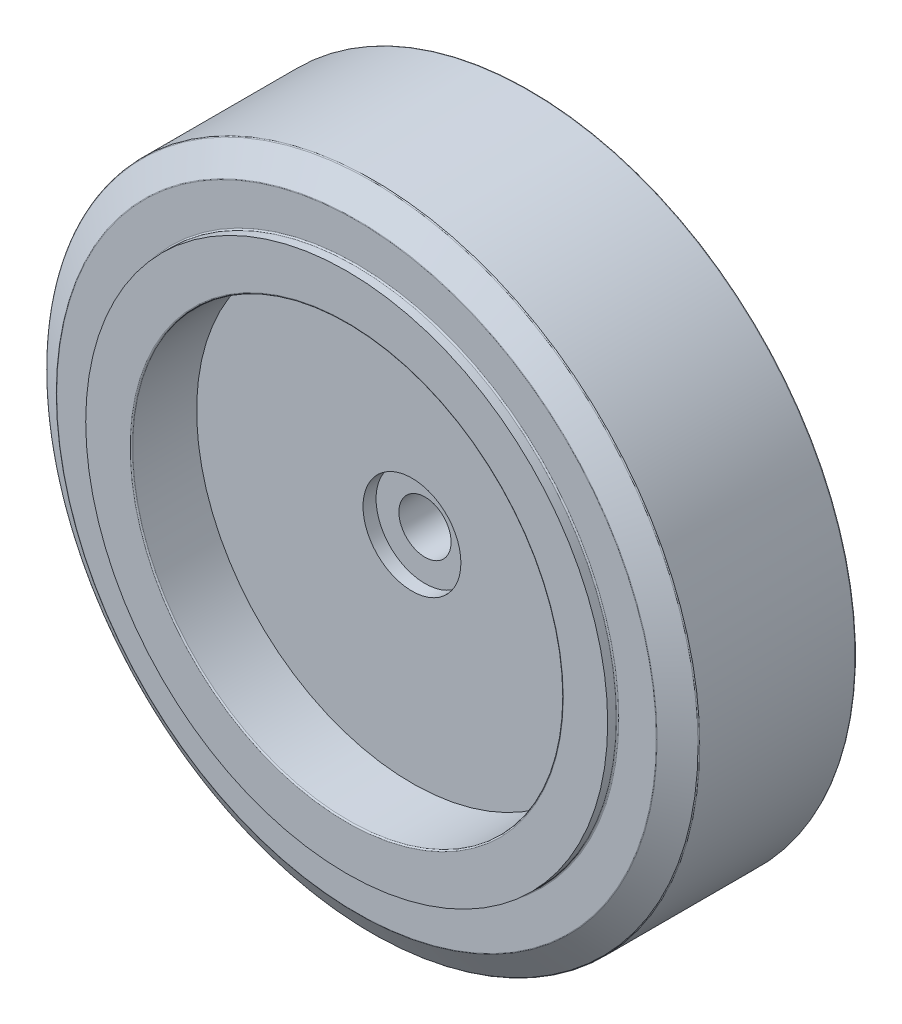
ISO-10303-21;
HEADER;
FILE_DESCRIPTION(('STEP AP214'),'2;1');
FILE_NAME('part.step','',(''),(''),'','','');
FILE_SCHEMA(('AUTOMOTIVE_DESIGN { 1 0 10303 214 1 1 1 1 }'));
ENDSEC;
DATA;
#1=APPLICATION_CONTEXT('core data for automotive mechanical design processes');
#2=APPLICATION_PROTOCOL_DEFINITION('international standard','automotive_design',2000,#1);
#3=PRODUCT_CONTEXT('',#1,'mechanical');
#4=PRODUCT('Part','Part','',(#3));
#5=PRODUCT_RELATED_PRODUCT_CATEGORY('part','',(#4));
#6=PRODUCT_DEFINITION_FORMATION('','',#4);
#7=PRODUCT_DEFINITION_CONTEXT('part definition',#1,'design');
#8=PRODUCT_DEFINITION('design','',#6,#7);
#9=PRODUCT_DEFINITION_SHAPE('','',#8);
#10=(LENGTH_UNIT() NAMED_UNIT(*) SI_UNIT(.MILLI.,.METRE.));
#11=(NAMED_UNIT(*) PLANE_ANGLE_UNIT() SI_UNIT($,.RADIAN.));
#12=(NAMED_UNIT(*) SI_UNIT($,.STERADIAN.) SOLID_ANGLE_UNIT());
#13=UNCERTAINTY_MEASURE_WITH_UNIT(LENGTH_MEASURE(1.E-05),#10,'distance_accuracy_value','');
#14=(GEOMETRIC_REPRESENTATION_CONTEXT(3) GLOBAL_UNCERTAINTY_ASSIGNED_CONTEXT((#13)) GLOBAL_UNIT_ASSIGNED_CONTEXT((#10,
#11,#12)) REPRESENTATION_CONTEXT('',''));
#15=CARTESIAN_POINT('',(0.,0.,0.));
#16=DIRECTION('',(0.,0.,1.));
#17=DIRECTION('',(1.,0.,0.));
#18=AXIS2_PLACEMENT_3D('',#15,#16,#17);
#19=CARTESIAN_POINT('',(0.,0.,-11.8891504716986));
#20=DIRECTION('',(0.,0.,-1.));
#21=DIRECTION('',(-1.,0.,0.));
#22=AXIS2_PLACEMENT_3D('',#19,#20,#21);
#23=TOROIDAL_SURFACE('',#22,49.8,0.2);
#24=CARTESIAN_POINT('',(0.,0.,-11.8891504716986));
#25=DIRECTION('',(0.,0.,1.));
#26=DIRECTION('',(-1.,0.,0.));
#27=AXIS2_PLACEMENT_3D('',#24,#25,#26);
#28=CIRCLE('',#27,50.);
#29=CARTESIAN_POINT('',(-50.,0.,-11.8891504716986));
#30=VERTEX_POINT('',#29);
#31=EDGE_CURVE('E40',#30,#30,#28,.T.);
#32=ORIENTED_EDGE('',*,*,#31,.F.);
#33=EDGE_LOOP('',(#32));
#34=FACE_BOUND('',#33,.T.);
#35=CARTESIAN_POINT('',(0.,0.,-12.0587501324996));
#36=DIRECTION('',(0.,0.,-1.));
#37=DIRECTION('',(1.,0.,0.));
#38=AXIS2_PLACEMENT_3D('',#35,#36,#37);
#39=CIRCLE('',#38,49.9059997880006);
#40=CARTESIAN_POINT('',(-49.9059997880006,0.,-12.0587501324996));
#41=VERTEX_POINT('',#40);
#42=EDGE_CURVE('E27',#41,#41,#39,.T.);
#43=ORIENTED_EDGE('',*,*,#42,.F.);
#44=EDGE_LOOP('',(#43));
#45=FACE_BOUND('',#44,.T.);
#46=ADVANCED_FACE('F16',(#34,#45),#23,.T.);
#47=CARTESIAN_POINT('',(0.,0.,14.3));
#48=DIRECTION('',(0.,0.,1.));
#49=DIRECTION('',(1.,0.,0.));
#50=AXIS2_PLACEMENT_3D('',#47,#48,#49);
#51=TOROIDAL_SURFACE('',#50,45.9426407547177,0.2);
#52=CARTESIAN_POINT('',(0.,0.,14.469599660801));
#53=DIRECTION('',(0.,0.,-1.));
#54=DIRECTION('',(1.,0.,0.));
#55=AXIS2_PLACEMENT_3D('',#52,#53,#54);
#56=CIRCLE('',#55,46.0486405427184);
#57=CARTESIAN_POINT('',(46.0486405427184,0.,14.469599660801));
#58=VERTEX_POINT('',#57);
#59=EDGE_CURVE('E174',#58,#58,#56,.T.);
#60=ORIENTED_EDGE('',*,*,#59,.F.);
#61=EDGE_LOOP('',(#60));
#62=FACE_BOUND('',#61,.T.);
#63=CARTESIAN_POINT('',(0.,0.,14.5));
#64=DIRECTION('',(0.,0.,1.));
#65=DIRECTION('',(1.,0.,0.));
#66=AXIS2_PLACEMENT_3D('',#63,#64,#65);
#67=CIRCLE('',#66,45.9426407547177);
#68=CARTESIAN_POINT('',(45.9426407547177,0.,14.5));
#69=VERTEX_POINT('',#68);
#70=EDGE_CURVE('E143',#69,#69,#67,.T.);
#71=ORIENTED_EDGE('',*,*,#70,.F.);
#72=EDGE_LOOP('',(#71));
#73=FACE_BOUND('',#72,.T.);
#74=ADVANCED_FACE('F274',(#62,#73),#51,.T.);
#75=CARTESIAN_POINT('',(0.,0.,14.7));
#76=DIRECTION('',(0.,0.,1.));
#77=DIRECTION('',(1.,0.,0.));
#78=AXIS2_PLACEMENT_3D('',#75,#76,#77);
#79=TOROIDAL_SURFACE('',#78,40.2,0.2);
#80=CARTESIAN_POINT('',(0.,0.,14.7));
#81=DIRECTION('',(0.,0.,1.));
#82=DIRECTION('',(1.,0.,0.));
#83=AXIS2_PLACEMENT_3D('',#80,#81,#82);
#84=CIRCLE('',#83,40.);
#85=CARTESIAN_POINT('',(40.,0.,14.7));
#86=VERTEX_POINT('',#85);
#87=EDGE_CURVE('E205',#86,#86,#84,.T.);
#88=ORIENTED_EDGE('',*,*,#87,.F.);
#89=EDGE_LOOP('',(#88));
#90=FACE_BOUND('',#89,.T.);
#91=CARTESIAN_POINT('',(0.,0.,14.5));
#92=DIRECTION('',(0.,0.,-1.));
#93=DIRECTION('',(1.,0.,0.));
#94=AXIS2_PLACEMENT_3D('',#91,#92,#93);
#95=CIRCLE('',#94,40.2);
#96=CARTESIAN_POINT('',(40.2,0.,14.5));
#97=VERTEX_POINT('',#96);
#98=EDGE_CURVE('E224',#97,#97,#95,.T.);
#99=ORIENTED_EDGE('',*,*,#98,.F.);
#100=EDGE_LOOP('',(#99));
#101=FACE_BOUND('',#100,.T.);
#102=ADVANCED_FACE('F279',(#90,#101),#79,.F.);
#103=CARTESIAN_POINT('',(0.,0.,-14.3));
#104=DIRECTION('',(0.,0.,-1.));
#105=DIRECTION('',(-1.,0.,0.));
#106=AXIS2_PLACEMENT_3D('',#103,#104,#105);
#107=TOROIDAL_SURFACE('',#106,45.9426407547177,0.2);
#108=CARTESIAN_POINT('',(0.,0.,-14.469599660801));
#109=DIRECTION('',(0.,0.,1.));
#110=DIRECTION('',(-1.,0.,0.));
#111=AXIS2_PLACEMENT_3D('',#108,#109,#110);
#112=CIRCLE('',#111,46.0486405427184);
#113=CARTESIAN_POINT('',(-46.0486405427184,0.,-14.469599660801));
#114=VERTEX_POINT('',#113);
#115=EDGE_CURVE('E11',#114,#114,#112,.T.);
#116=ORIENTED_EDGE('',*,*,#115,.F.);
#117=EDGE_LOOP('',(#116));
#118=FACE_BOUND('',#117,.T.);
#119=CARTESIAN_POINT('',(0.,0.,-14.5));
#120=DIRECTION('',(0.,0.,-1.));
#121=DIRECTION('',(-1.,0.,0.));
#122=AXIS2_PLACEMENT_3D('',#119,#120,#121);
#123=CIRCLE('',#122,45.9426407547177);
#124=CARTESIAN_POINT('',(-45.9426407547177,0.,-14.5));
#125=VERTEX_POINT('',#124);
#126=EDGE_CURVE('E230',#125,#125,#123,.T.);
#127=ORIENTED_EDGE('',*,*,#126,.F.);
#128=EDGE_LOOP('',(#127));
#129=FACE_BOUND('',#128,.T.);
#130=ADVANCED_FACE('F293',(#118,#129),#107,.T.);
#131=CARTESIAN_POINT('',(0.,0.,11.8891504716986));
#132=DIRECTION('',(0.,0.,1.));
#133=DIRECTION('',(1.,0.,0.));
#134=AXIS2_PLACEMENT_3D('',#131,#132,#133);
#135=TOROIDAL_SURFACE('',#134,49.8,0.2);
#136=CARTESIAN_POINT('',(0.,0.,11.8891504716986));
#137=DIRECTION('',(0.,0.,-1.));
#138=DIRECTION('',(1.,0.,0.));
#139=AXIS2_PLACEMENT_3D('',#136,#137,#138);
#140=CIRCLE('',#139,50.);
#141=CARTESIAN_POINT('',(50.,0.,11.8891504716986));
#142=VERTEX_POINT('',#141);
#143=EDGE_CURVE('E145',#142,#142,#140,.T.);
#144=ORIENTED_EDGE('',*,*,#143,.F.);
#145=EDGE_LOOP('',(#144));
#146=FACE_BOUND('',#145,.T.);
#147=CARTESIAN_POINT('',(0.,0.,12.0587501324996));
#148=DIRECTION('',(0.,0.,1.));
#149=DIRECTION('',(-1.,0.,0.));
#150=AXIS2_PLACEMENT_3D('',#147,#148,#149);
#151=CIRCLE('',#150,49.9059997880006);
#152=CARTESIAN_POINT('',(49.9059997880006,0.,12.0587501324996));
#153=VERTEX_POINT('',#152);
#154=EDGE_CURVE('E172',#153,#153,#151,.T.);
#155=ORIENTED_EDGE('',*,*,#154,.F.);
#156=EDGE_LOOP('',(#155));
#157=FACE_BOUND('',#156,.T.);
#158=ADVANCED_FACE('F332',(#146,#157),#135,.T.);
#159=CARTESIAN_POINT('',(0.,0.,-14.7));
#160=DIRECTION('',(0.,0.,-1.));
#161=DIRECTION('',(-1.,0.,0.));
#162=AXIS2_PLACEMENT_3D('',#159,#160,#161);
#163=TOROIDAL_SURFACE('',#162,40.2,0.2);
#164=CARTESIAN_POINT('',(0.,0.,-14.7));
#165=DIRECTION('',(0.,0.,-1.));
#166=DIRECTION('',(-1.,0.,0.));
#167=AXIS2_PLACEMENT_3D('',#164,#165,#166);
#168=CIRCLE('',#167,40.);
#169=CARTESIAN_POINT('',(-40.,0.,-14.7));
#170=VERTEX_POINT('',#169);
#171=EDGE_CURVE('E128',#170,#170,#168,.T.);
#172=ORIENTED_EDGE('',*,*,#171,.F.);
#173=EDGE_LOOP('',(#172));
#174=FACE_BOUND('',#173,.T.);
#175=CARTESIAN_POINT('',(0.,0.,-14.5));
#176=DIRECTION('',(0.,0.,1.));
#177=DIRECTION('',(-1.,0.,0.));
#178=AXIS2_PLACEMENT_3D('',#175,#176,#177);
#179=CIRCLE('',#178,40.2);
#180=CARTESIAN_POINT('',(-40.2,0.,-14.5));
#181=VERTEX_POINT('',#180);
#182=EDGE_CURVE('E196',#181,#181,#179,.T.);
#183=ORIENTED_EDGE('',*,*,#182,.F.);
#184=EDGE_LOOP('',(#183));
#185=FACE_BOUND('',#184,.T.);
#186=ADVANCED_FACE('F335',(#174,#185),#163,.F.);
#187=CARTESIAN_POINT('',(0.,0.,-15.8));
#188=DIRECTION('',(0.,0.,1.));
#189=DIRECTION('',(1.,0.,0.));
#190=AXIS2_PLACEMENT_3D('',#187,#188,#189);
#191=TOROIDAL_SURFACE('',#190,33.2,0.2);
#192=CARTESIAN_POINT('',(0.,0.,-15.8));
#193=DIRECTION('',(0.,0.,-1.));
#194=DIRECTION('',(1.,0.,0.));
#195=AXIS2_PLACEMENT_3D('',#192,#193,#194);
#196=CIRCLE('',#195,33.);
#197=CARTESIAN_POINT('',(33.,0.,-15.8));
#198=VERTEX_POINT('',#197);
#199=EDGE_CURVE('E122',#198,#198,#196,.T.);
#200=ORIENTED_EDGE('',*,*,#199,.F.);
#201=EDGE_LOOP('',(#200));
#202=FACE_BOUND('',#201,.T.);
#203=CARTESIAN_POINT('',(0.,0.,-16.));
#204=DIRECTION('',(0.,0.,1.));
#205=DIRECTION('',(1.,0.,0.));
#206=AXIS2_PLACEMENT_3D('',#203,#204,#205);
#207=CIRCLE('',#206,33.2);
#208=CARTESIAN_POINT('',(33.2,0.,-16.));
#209=VERTEX_POINT('',#208);
#210=EDGE_CURVE('E194',#209,#209,#207,.T.);
#211=ORIENTED_EDGE('',*,*,#210,.F.);
#212=EDGE_LOOP('',(#211));
#213=FACE_BOUND('',#212,.T.);
#214=ADVANCED_FACE('F123',(#202,#213),#191,.T.);
#215=CARTESIAN_POINT('',(0.,0.,15.8));
#216=DIRECTION('',(0.,0.,1.));
#217=DIRECTION('',(1.,0.,0.));
#218=AXIS2_PLACEMENT_3D('',#215,#216,#217);
#219=TOROIDAL_SURFACE('',#218,33.2,0.2);
#220=CARTESIAN_POINT('',(0.,0.,16.));
#221=DIRECTION('',(0.,0.,-1.));
#222=DIRECTION('',(1.,0.,0.));
#223=AXIS2_PLACEMENT_3D('',#220,#221,#222);
#224=CIRCLE('',#223,33.2);
#225=CARTESIAN_POINT('',(33.2,0.,16.));
#226=VERTEX_POINT('',#225);
#227=EDGE_CURVE('E168',#226,#226,#224,.T.);
#228=ORIENTED_EDGE('',*,*,#227,.F.);
#229=EDGE_LOOP('',(#228));
#230=FACE_BOUND('',#229,.T.);
#231=CARTESIAN_POINT('',(0.,0.,15.8));
#232=DIRECTION('',(0.,0.,1.));
#233=DIRECTION('',(1.,0.,0.));
#234=AXIS2_PLACEMENT_3D('',#231,#232,#233);
#235=CIRCLE('',#234,33.);
#236=CARTESIAN_POINT('',(33.,0.,15.8));
#237=VERTEX_POINT('',#236);
#238=EDGE_CURVE('E153',#237,#237,#235,.T.);
#239=ORIENTED_EDGE('',*,*,#238,.F.);
#240=EDGE_LOOP('',(#239));
#241=FACE_BOUND('',#240,.T.);
#242=ADVANCED_FACE('F313',(#230,#241),#219,.T.);
#243=CARTESIAN_POINT('',(0.,0.,-14.5));
#244=DIRECTION('',(0.,0.,1.));
#245=DIRECTION('',(1.,0.,0.));
#246=AXIS2_PLACEMENT_3D('',#243,#244,#245);
#247=CONICAL_SURFACE('',#246,46.,1.01219701145134);
#248=ORIENTED_EDGE('',*,*,#115,.T.);
#249=EDGE_LOOP('',(#248));
#250=FACE_BOUND('',#249,.T.);
#251=ORIENTED_EDGE('',*,*,#42,.T.);
#252=EDGE_LOOP('',(#251));
#253=FACE_BOUND('',#252,.T.);
#254=ADVANCED_FACE('F316',(#250,#253),#247,.T.);
#255=CARTESIAN_POINT('',(0.,0.,14.5));
#256=DIRECTION('',(0.,0.,-1.));
#257=DIRECTION('',(-1.,0.,0.));
#258=AXIS2_PLACEMENT_3D('',#255,#256,#257);
#259=CONICAL_SURFACE('',#258,46.,1.01219701145134);
#260=ORIENTED_EDGE('',*,*,#59,.T.);
#261=EDGE_LOOP('',(#260));
#262=FACE_BOUND('',#261,.T.);
#263=ORIENTED_EDGE('',*,*,#154,.T.);
#264=EDGE_LOOP('',(#263));
#265=FACE_BOUND('',#264,.T.);
#266=ADVANCED_FACE('F298',(#262,#265),#259,.T.);
#267=CARTESIAN_POINT('',(0.,0.,-16.));
#268=DIRECTION('',(0.,0.,1.));
#269=DIRECTION('',(1.,0.,0.));
#270=AXIS2_PLACEMENT_3D('',#267,#268,#269);
#271=CYLINDRICAL_SURFACE('',#270,4.);
#272=CARTESIAN_POINT('',(0.,0.,-4.));
#273=DIRECTION('',(0.,0.,-1.));
#274=DIRECTION('',(-1.,0.,0.));
#275=AXIS2_PLACEMENT_3D('',#272,#273,#274);
#276=CIRCLE('',#275,4.);
#277=CARTESIAN_POINT('',(-4.,0.,-4.));
#278=VERTEX_POINT('',#277);
#279=EDGE_CURVE('E175',#278,#278,#276,.T.);
#280=ORIENTED_EDGE('',*,*,#279,.T.);
#281=EDGE_LOOP('',(#280));
#282=FACE_BOUND('',#281,.T.);
#283=CARTESIAN_POINT('',(0.,0.,4.));
#284=DIRECTION('',(0.,0.,1.));
#285=DIRECTION('',(1.,0.,0.));
#286=AXIS2_PLACEMENT_3D('',#283,#284,#285);
#287=CIRCLE('',#286,4.);
#288=CARTESIAN_POINT('',(4.,0.,4.));
#289=VERTEX_POINT('',#288);
#290=EDGE_CURVE('E184',#289,#289,#287,.T.);
#291=ORIENTED_EDGE('',*,*,#290,.T.);
#292=EDGE_LOOP('',(#291));
#293=FACE_BOUND('',#292,.T.);
#294=ADVANCED_FACE('F295',(#282,#293),#271,.F.);
#295=CARTESIAN_POINT('',(0.,0.,-4.));
#296=DIRECTION('',(0.,0.,-1.));
#297=DIRECTION('',(-1.,0.,0.));
#298=AXIS2_PLACEMENT_3D('',#295,#296,#297);
#299=CYLINDRICAL_SURFACE('',#298,7.5);
#300=CARTESIAN_POINT('',(0.,0.,-4.));
#301=DIRECTION('',(0.,0.,1.));
#302=DIRECTION('',(1.,0.,0.));
#303=AXIS2_PLACEMENT_3D('',#300,#301,#302);
#304=CIRCLE('',#303,7.5);
#305=CARTESIAN_POINT('',(7.5,0.,-4.));
#306=VERTEX_POINT('',#305);
#307=EDGE_CURVE('E136',#306,#306,#304,.T.);
#308=ORIENTED_EDGE('',*,*,#307,.T.);
#309=EDGE_LOOP('',(#308));
#310=FACE_BOUND('',#309,.T.);
#311=CARTESIAN_POINT('',(0.,0.,-6.));
#312=DIRECTION('',(0.,0.,1.));
#313=DIRECTION('',(1.,0.,0.));
#314=AXIS2_PLACEMENT_3D('',#311,#312,#313);
#315=CIRCLE('',#314,7.5);
#316=CARTESIAN_POINT('',(-7.5,0.,-6.));
#317=VERTEX_POINT('',#316);
#318=EDGE_CURVE('E146',#317,#317,#315,.T.);
#319=ORIENTED_EDGE('',*,*,#318,.F.);
#320=EDGE_LOOP('',(#319));
#321=FACE_BOUND('',#320,.T.);
#322=ADVANCED_FACE('F288',(#310,#321),#299,.F.);
#323=CARTESIAN_POINT('',(0.,0.,-6.));
#324=DIRECTION('',(0.,0.,-1.));
#325=DIRECTION('',(-1.,0.,0.));
#326=AXIS2_PLACEMENT_3D('',#323,#324,#325);
#327=CYLINDRICAL_SURFACE('',#326,33.);
#328=CARTESIAN_POINT('',(0.,0.,-6.));
#329=DIRECTION('',(0.,0.,1.));
#330=DIRECTION('',(1.,0.,0.));
#331=AXIS2_PLACEMENT_3D('',#328,#329,#330);
#332=CIRCLE('',#331,33.);
#333=CARTESIAN_POINT('',(33.,0.,-6.));
#334=VERTEX_POINT('',#333);
#335=EDGE_CURVE('E127',#334,#334,#332,.T.);
#336=ORIENTED_EDGE('',*,*,#335,.T.);
#337=EDGE_LOOP('',(#336));
#338=FACE_BOUND('',#337,.T.);
#339=ORIENTED_EDGE('',*,*,#199,.T.);
#340=EDGE_LOOP('',(#339));
#341=FACE_BOUND('',#340,.T.);
#342=ADVANCED_FACE('F286',(#338,#341),#327,.F.);
#343=CARTESIAN_POINT('',(0.,0.,-14.5));
#344=DIRECTION('',(0.,0.,-1.));
#345=DIRECTION('',(-1.,0.,0.));
#346=AXIS2_PLACEMENT_3D('',#343,#344,#345);
#347=CYLINDRICAL_SURFACE('',#346,40.);
#348=ORIENTED_EDGE('',*,*,#171,.T.);
#349=EDGE_LOOP('',(#348));
#350=FACE_BOUND('',#349,.T.);
#351=CARTESIAN_POINT('',(0.,0.,-16.));
#352=DIRECTION('',(0.,0.,1.));
#353=DIRECTION('',(1.,0.,0.));
#354=AXIS2_PLACEMENT_3D('',#351,#352,#353);
#355=CIRCLE('',#354,40.);
#356=CARTESIAN_POINT('',(-40.,0.,-16.));
#357=VERTEX_POINT('',#356);
#358=EDGE_CURVE('E140',#357,#357,#355,.T.);
#359=ORIENTED_EDGE('',*,*,#358,.T.);
#360=EDGE_LOOP('',(#359));
#361=FACE_BOUND('',#360,.T.);
#362=ADVANCED_FACE('F253',(#350,#361),#347,.T.);
#363=CARTESIAN_POINT('',(0.,0.,4.));
#364=DIRECTION('',(0.,0.,1.));
#365=DIRECTION('',(1.,0.,0.));
#366=AXIS2_PLACEMENT_3D('',#363,#364,#365);
#367=CYLINDRICAL_SURFACE('',#366,7.5);
#368=CARTESIAN_POINT('',(0.,0.,4.));
#369=DIRECTION('',(0.,0.,1.));
#370=DIRECTION('',(1.,0.,0.));
#371=AXIS2_PLACEMENT_3D('',#368,#369,#370);
#372=CIRCLE('',#371,7.5);
#373=CARTESIAN_POINT('',(7.5,0.,4.));
#374=VERTEX_POINT('',#373);
#375=EDGE_CURVE('E226',#374,#374,#372,.T.);
#376=ORIENTED_EDGE('',*,*,#375,.F.);
#377=EDGE_LOOP('',(#376));
#378=FACE_BOUND('',#377,.T.);
#379=CARTESIAN_POINT('',(0.,0.,6.));
#380=DIRECTION('',(0.,0.,1.));
#381=DIRECTION('',(1.,0.,0.));
#382=AXIS2_PLACEMENT_3D('',#379,#380,#381);
#383=CIRCLE('',#382,7.5);
#384=CARTESIAN_POINT('',(7.5,0.,6.));
#385=VERTEX_POINT('',#384);
#386=EDGE_CURVE('E211',#385,#385,#383,.T.);
#387=ORIENTED_EDGE('',*,*,#386,.T.);
#388=EDGE_LOOP('',(#387));
#389=FACE_BOUND('',#388,.T.);
#390=ADVANCED_FACE('F249',(#378,#389),#367,.F.);
#391=CARTESIAN_POINT('',(0.,0.,14.5));
#392=DIRECTION('',(0.,0.,1.));
#393=DIRECTION('',(1.,0.,0.));
#394=AXIS2_PLACEMENT_3D('',#391,#392,#393);
#395=CYLINDRICAL_SURFACE('',#394,40.);
#396=ORIENTED_EDGE('',*,*,#87,.T.);
#397=EDGE_LOOP('',(#396));
#398=FACE_BOUND('',#397,.T.);
#399=CARTESIAN_POINT('',(0.,0.,16.));
#400=DIRECTION('',(0.,0.,1.));
#401=DIRECTION('',(1.,0.,0.));
#402=AXIS2_PLACEMENT_3D('',#399,#400,#401);
#403=CIRCLE('',#402,40.);
#404=CARTESIAN_POINT('',(40.,0.,16.));
#405=VERTEX_POINT('',#404);
#406=EDGE_CURVE('E157',#405,#405,#403,.T.);
#407=ORIENTED_EDGE('',*,*,#406,.F.);
#408=EDGE_LOOP('',(#407));
#409=FACE_BOUND('',#408,.T.);
#410=ADVANCED_FACE('F252',(#398,#409),#395,.T.);
#411=CARTESIAN_POINT('',(0.,0.,6.));
#412=DIRECTION('',(0.,0.,1.));
#413=DIRECTION('',(1.,0.,0.));
#414=AXIS2_PLACEMENT_3D('',#411,#412,#413);
#415=CYLINDRICAL_SURFACE('',#414,33.);
#416=CARTESIAN_POINT('',(0.,0.,6.));
#417=DIRECTION('',(0.,0.,1.));
#418=DIRECTION('',(1.,0.,0.));
#419=AXIS2_PLACEMENT_3D('',#416,#417,#418);
#420=CIRCLE('',#419,33.);
#421=CARTESIAN_POINT('',(33.,0.,6.));
#422=VERTEX_POINT('',#421);
#423=EDGE_CURVE('E20',#422,#422,#420,.T.);
#424=ORIENTED_EDGE('',*,*,#423,.F.);
#425=EDGE_LOOP('',(#424));
#426=FACE_BOUND('',#425,.T.);
#427=ORIENTED_EDGE('',*,*,#238,.T.);
#428=EDGE_LOOP('',(#427));
#429=FACE_BOUND('',#428,.T.);
#430=ADVANCED_FACE('F299',(#426,#429),#415,.F.);
#431=CARTESIAN_POINT('',(0.,0.,16.));
#432=DIRECTION('',(0.,0.,-1.));
#433=DIRECTION('',(-1.,0.,0.));
#434=AXIS2_PLACEMENT_3D('',#431,#432,#433);
#435=CYLINDRICAL_SURFACE('',#434,50.);
#436=ORIENTED_EDGE('',*,*,#143,.T.);
#437=EDGE_LOOP('',(#436));
#438=FACE_BOUND('',#437,.T.);
#439=ORIENTED_EDGE('',*,*,#31,.T.);
#440=EDGE_LOOP('',(#439));
#441=FACE_BOUND('',#440,.T.);
#442=ADVANCED_FACE('F301',(#438,#441),#435,.T.);
#443=CARTESIAN_POINT('',(0.,0.,-6.));
#444=DIRECTION('',(0.,0.,-1.));
#445=DIRECTION('',(0.,-1.,0.));
#446=AXIS2_PLACEMENT_3D('',#443,#444,#445);
#447=PLANE('',#446);
#448=ORIENTED_EDGE('',*,*,#335,.F.);
#449=EDGE_LOOP('',(#448));
#450=FACE_BOUND('',#449,.T.);
#451=ORIENTED_EDGE('',*,*,#318,.T.);
#452=EDGE_LOOP('',(#451));
#453=FACE_BOUND('',#452,.T.);
#454=ADVANCED_FACE('F267',(#450,#453),#447,.T.);
#455=CARTESIAN_POINT('',(0.,0.,16.));
#456=DIRECTION('',(0.,0.,1.));
#457=DIRECTION('',(1.,0.,0.));
#458=AXIS2_PLACEMENT_3D('',#455,#456,#457);
#459=PLANE('',#458);
#460=ORIENTED_EDGE('',*,*,#406,.T.);
#461=EDGE_LOOP('',(#460));
#462=FACE_BOUND('',#461,.T.);
#463=ORIENTED_EDGE('',*,*,#227,.T.);
#464=EDGE_LOOP('',(#463));
#465=FACE_BOUND('',#464,.T.);
#466=ADVANCED_FACE('F258',(#462,#465),#459,.T.);
#467=CARTESIAN_POINT('',(0.,0.,6.));
#468=DIRECTION('',(0.,0.,1.));
#469=DIRECTION('',(1.,0.,0.));
#470=AXIS2_PLACEMENT_3D('',#467,#468,#469);
#471=PLANE('',#470);
#472=ORIENTED_EDGE('',*,*,#423,.T.);
#473=EDGE_LOOP('',(#472));
#474=FACE_BOUND('',#473,.T.);
#475=ORIENTED_EDGE('',*,*,#386,.F.);
#476=EDGE_LOOP('',(#475));
#477=FACE_BOUND('',#476,.T.);
#478=ADVANCED_FACE('F256',(#474,#477),#471,.T.);
#479=CARTESIAN_POINT('',(0.,0.,14.5));
#480=DIRECTION('',(0.,0.,1.));
#481=DIRECTION('',(1.,0.,0.));
#482=AXIS2_PLACEMENT_3D('',#479,#480,#481);
#483=PLANE('',#482);
#484=ORIENTED_EDGE('',*,*,#70,.T.);
#485=EDGE_LOOP('',(#484));
#486=FACE_BOUND('',#485,.T.);
#487=ORIENTED_EDGE('',*,*,#98,.T.);
#488=EDGE_LOOP('',(#487));
#489=FACE_BOUND('',#488,.T.);
#490=ADVANCED_FACE('F18',(#486,#489),#483,.T.);
#491=CARTESIAN_POINT('',(0.,0.,4.));
#492=DIRECTION('',(0.,0.,1.));
#493=DIRECTION('',(1.,0.,0.));
#494=AXIS2_PLACEMENT_3D('',#491,#492,#493);
#495=PLANE('',#494);
#496=ORIENTED_EDGE('',*,*,#375,.T.);
#497=EDGE_LOOP('',(#496));
#498=FACE_BOUND('',#497,.T.);
#499=ORIENTED_EDGE('',*,*,#290,.F.);
#500=EDGE_LOOP('',(#499));
#501=FACE_BOUND('',#500,.T.);
#502=ADVANCED_FACE('F246',(#498,#501),#495,.T.);
#503=CARTESIAN_POINT('',(0.,0.,-14.5));
#504=DIRECTION('',(0.,0.,-1.));
#505=DIRECTION('',(0.,-1.,0.));
#506=AXIS2_PLACEMENT_3D('',#503,#504,#505);
#507=PLANE('',#506);
#508=ORIENTED_EDGE('',*,*,#126,.T.);
#509=EDGE_LOOP('',(#508));
#510=FACE_BOUND('',#509,.T.);
#511=ORIENTED_EDGE('',*,*,#182,.T.);
#512=EDGE_LOOP('',(#511));
#513=FACE_BOUND('',#512,.T.);
#514=ADVANCED_FACE('F311',(#510,#513),#507,.T.);
#515=CARTESIAN_POINT('',(0.,0.,-16.));
#516=DIRECTION('',(0.,0.,1.));
#517=DIRECTION('',(1.,0.,0.));
#518=AXIS2_PLACEMENT_3D('',#515,#516,#517);
#519=PLANE('',#518);
#520=ORIENTED_EDGE('',*,*,#358,.F.);
#521=EDGE_LOOP('',(#520));
#522=FACE_BOUND('',#521,.T.);
#523=ORIENTED_EDGE('',*,*,#210,.T.);
#524=EDGE_LOOP('',(#523));
#525=FACE_BOUND('',#524,.T.);
#526=ADVANCED_FACE('F307',(#522,#525),#519,.F.);
#527=CARTESIAN_POINT('',(0.,0.,-4.));
#528=DIRECTION('',(0.,0.,-1.));
#529=DIRECTION('',(0.,-1.,0.));
#530=AXIS2_PLACEMENT_3D('',#527,#528,#529);
#531=PLANE('',#530);
#532=ORIENTED_EDGE('',*,*,#307,.F.);
#533=EDGE_LOOP('',(#532));
#534=FACE_BOUND('',#533,.T.);
#535=ORIENTED_EDGE('',*,*,#279,.F.);
#536=EDGE_LOOP('',(#535));
#537=FACE_BOUND('',#536,.T.);
#538=ADVANCED_FACE('F310',(#534,#537),#531,.T.);
#539=CLOSED_SHELL('',(#46,#74,#102,#130,#158,#186,#214,#242,#254,#266,#294,#322,#342,#362,#390,
#410,#430,#442,#454,#466,#478,#490,#502,#514,#526,#538));
#540=MANIFOLD_SOLID_BREP('B1',#539);
#541=ADVANCED_BREP_SHAPE_REPRESENTATION('',(#18,#540),#14);
#542=SHAPE_DEFINITION_REPRESENTATION(#9,#541);
ENDSEC;
END-ISO-10303-21;
